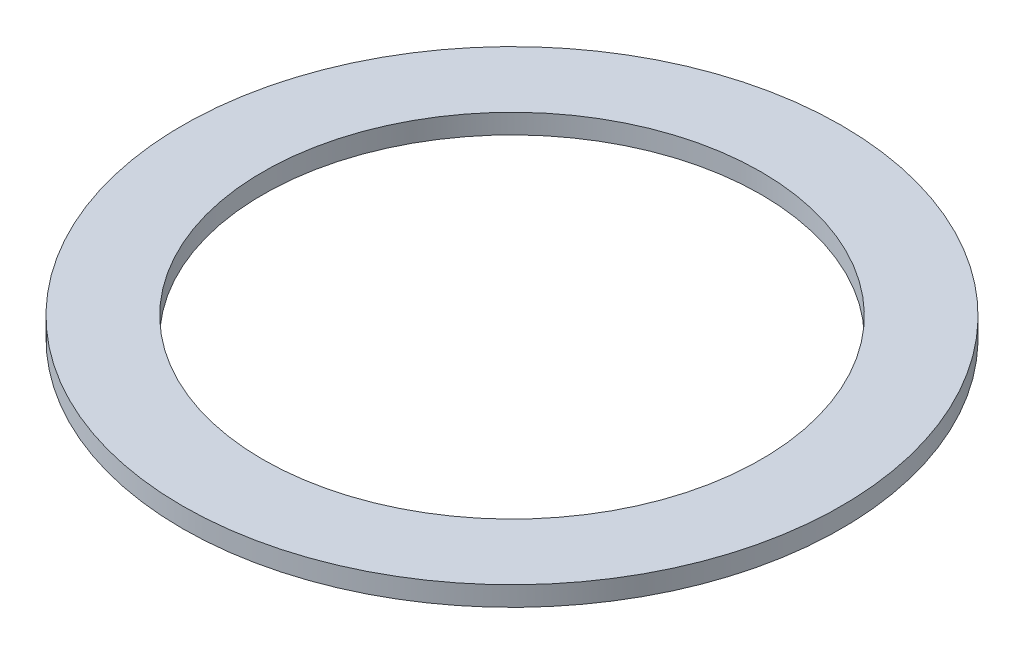
ISO-10303-21;
HEADER;
FILE_DESCRIPTION(('STEP AP214'),'2;1');
FILE_NAME('part.step','',(''),(''),'','','');
FILE_SCHEMA(('AUTOMOTIVE_DESIGN { 1 0 10303 214 1 1 1 1 }'));
ENDSEC;
DATA;
#1=APPLICATION_CONTEXT('core data for automotive mechanical design processes');
#2=APPLICATION_PROTOCOL_DEFINITION('international standard','automotive_design',2000,#1);
#3=PRODUCT_CONTEXT('',#1,'mechanical');
#4=PRODUCT('Part','Part','',(#3));
#5=PRODUCT_RELATED_PRODUCT_CATEGORY('part','',(#4));
#6=PRODUCT_DEFINITION_FORMATION('','',#4);
#7=PRODUCT_DEFINITION_CONTEXT('part definition',#1,'design');
#8=PRODUCT_DEFINITION('design','',#6,#7);
#9=PRODUCT_DEFINITION_SHAPE('','',#8);
#10=(LENGTH_UNIT() NAMED_UNIT(*) SI_UNIT(.MILLI.,.METRE.));
#11=(NAMED_UNIT(*) PLANE_ANGLE_UNIT() SI_UNIT($,.RADIAN.));
#12=(NAMED_UNIT(*) SI_UNIT($,.STERADIAN.) SOLID_ANGLE_UNIT());
#13=UNCERTAINTY_MEASURE_WITH_UNIT(LENGTH_MEASURE(1.E-05),#10,'distance_accuracy_value','');
#14=(GEOMETRIC_REPRESENTATION_CONTEXT(3) GLOBAL_UNCERTAINTY_ASSIGNED_CONTEXT((#13)) GLOBAL_UNIT_ASSIGNED_CONTEXT((#10,
#11,#12)) REPRESENTATION_CONTEXT('',''));
#15=CARTESIAN_POINT('',(0.,0.,0.));
#16=DIRECTION('',(0.,0.,1.));
#17=DIRECTION('',(1.,0.,0.));
#18=AXIS2_PLACEMENT_3D('',#15,#16,#17);
#19=CARTESIAN_POINT('',(0.,0.,0.));
#20=DIRECTION('',(0.,1.,0.));
#21=DIRECTION('',(1.,0.,0.));
#22=AXIS2_PLACEMENT_3D('',#19,#20,#21);
#23=PLANE('',#22);
#24=CARTESIAN_POINT('',(0.,0.,0.));
#25=DIRECTION('',(0.,1.,0.));
#26=DIRECTION('',(0.,0.,1.));
#27=AXIS2_PLACEMENT_3D('',#24,#25,#26);
#28=CIRCLE('',#27,3.175);
#29=CARTESIAN_POINT('',(0.,0.,3.175));
#30=VERTEX_POINT('',#29);
#31=EDGE_CURVE('E31',#30,#30,#28,.T.);
#32=ORIENTED_EDGE('',*,*,#31,.T.);
#33=EDGE_LOOP('',(#32));
#34=FACE_BOUND('',#33,.T.);
#35=CARTESIAN_POINT('',(0.,0.,0.));
#36=DIRECTION('',(0.,1.,0.));
#37=DIRECTION('',(0.,0.,1.));
#38=AXIS2_PLACEMENT_3D('',#35,#36,#37);
#39=CIRCLE('',#38,4.2);
#40=CARTESIAN_POINT('',(0.,0.,4.2));
#41=VERTEX_POINT('',#40);
#42=EDGE_CURVE('E10',#41,#41,#39,.T.);
#43=ORIENTED_EDGE('',*,*,#42,.F.);
#44=EDGE_LOOP('',(#43));
#45=FACE_BOUND('',#44,.T.);
#46=ADVANCED_FACE('F15',(#34,#45),#23,.F.);
#47=CARTESIAN_POINT('',(0.,0.25,0.));
#48=DIRECTION('',(0.,1.,0.));
#49=DIRECTION('',(1.,0.,0.));
#50=AXIS2_PLACEMENT_3D('',#47,#48,#49);
#51=PLANE('',#50);
#52=CARTESIAN_POINT('',(0.,0.25,0.));
#53=DIRECTION('',(0.,1.,0.));
#54=DIRECTION('',(0.,0.,1.));
#55=AXIS2_PLACEMENT_3D('',#52,#53,#54);
#56=CIRCLE('',#55,3.175);
#57=CARTESIAN_POINT('',(0.,0.25,3.175));
#58=VERTEX_POINT('',#57);
#59=EDGE_CURVE('E38',#58,#58,#56,.T.);
#60=ORIENTED_EDGE('',*,*,#59,.F.);
#61=EDGE_LOOP('',(#60));
#62=FACE_BOUND('',#61,.T.);
#63=CARTESIAN_POINT('',(0.,0.25,0.));
#64=DIRECTION('',(0.,1.,0.));
#65=DIRECTION('',(0.,0.,1.));
#66=AXIS2_PLACEMENT_3D('',#63,#64,#65);
#67=CIRCLE('',#66,4.2);
#68=CARTESIAN_POINT('',(0.,0.25,4.2));
#69=VERTEX_POINT('',#68);
#70=EDGE_CURVE('E22',#69,#69,#67,.T.);
#71=ORIENTED_EDGE('',*,*,#70,.T.);
#72=EDGE_LOOP('',(#71));
#73=FACE_BOUND('',#72,.T.);
#74=ADVANCED_FACE('F49',(#62,#73),#51,.T.);
#75=CARTESIAN_POINT('',(0.,0.25,0.));
#76=DIRECTION('',(0.,-1.,0.));
#77=DIRECTION('',(0.,0.,-1.));
#78=AXIS2_PLACEMENT_3D('',#75,#76,#77);
#79=CYLINDRICAL_SURFACE('',#78,4.2);
#80=ORIENTED_EDGE('',*,*,#42,.T.);
#81=EDGE_LOOP('',(#80));
#82=FACE_BOUND('',#81,.T.);
#83=ORIENTED_EDGE('',*,*,#70,.F.);
#84=EDGE_LOOP('',(#83));
#85=FACE_BOUND('',#84,.T.);
#86=ADVANCED_FACE('F51',(#82,#85),#79,.T.);
#87=CARTESIAN_POINT('',(0.,0.25,0.));
#88=DIRECTION('',(0.,-1.,0.));
#89=DIRECTION('',(0.,0.,-1.));
#90=AXIS2_PLACEMENT_3D('',#87,#88,#89);
#91=CYLINDRICAL_SURFACE('',#90,3.175);
#92=ORIENTED_EDGE('',*,*,#31,.F.);
#93=EDGE_LOOP('',(#92));
#94=FACE_BOUND('',#93,.T.);
#95=ORIENTED_EDGE('',*,*,#59,.T.);
#96=EDGE_LOOP('',(#95));
#97=FACE_BOUND('',#96,.T.);
#98=ADVANCED_FACE('F47',(#94,#97),#91,.F.);
#99=CLOSED_SHELL('',(#46,#74,#86,#98));
#100=MANIFOLD_SOLID_BREP('B1',#99);
#101=ADVANCED_BREP_SHAPE_REPRESENTATION('',(#18,#100),#14);
#102=SHAPE_DEFINITION_REPRESENTATION(#9,#101);
ENDSEC;
END-ISO-10303-21;
